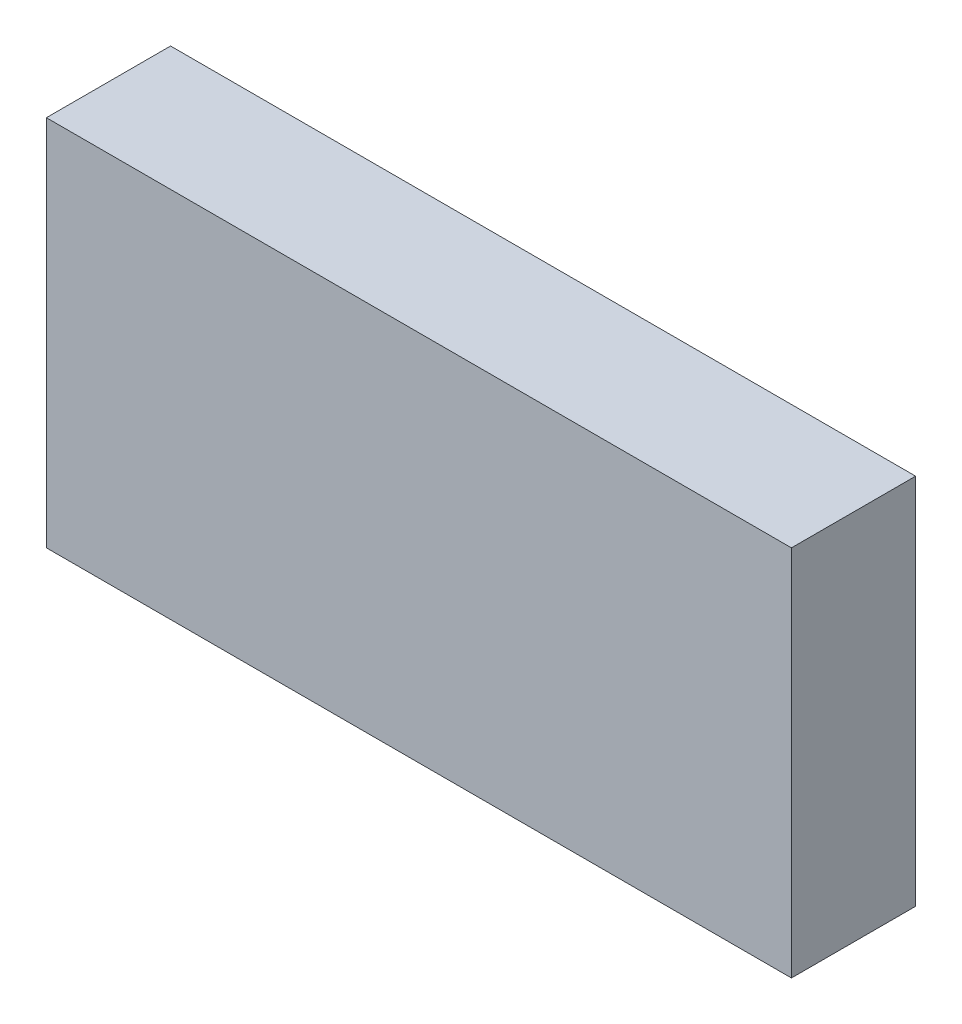
ISO-10303-21;
HEADER;
FILE_DESCRIPTION(('STEP AP214'),'2;1');
FILE_NAME('part.step','',(''),(''),'','','');
FILE_SCHEMA(('AUTOMOTIVE_DESIGN { 1 0 10303 214 1 1 1 1 }'));
ENDSEC;
DATA;
#1=APPLICATION_CONTEXT('core data for automotive mechanical design processes');
#2=APPLICATION_PROTOCOL_DEFINITION('international standard','automotive_design',2000,#1);
#3=PRODUCT_CONTEXT('',#1,'mechanical');
#4=PRODUCT('Part','Part','',(#3));
#5=PRODUCT_RELATED_PRODUCT_CATEGORY('part','',(#4));
#6=PRODUCT_DEFINITION_FORMATION('','',#4);
#7=PRODUCT_DEFINITION_CONTEXT('part definition',#1,'design');
#8=PRODUCT_DEFINITION('design','',#6,#7);
#9=PRODUCT_DEFINITION_SHAPE('','',#8);
#10=(LENGTH_UNIT() NAMED_UNIT(*) SI_UNIT(.MILLI.,.METRE.));
#11=(NAMED_UNIT(*) PLANE_ANGLE_UNIT() SI_UNIT($,.RADIAN.));
#12=(NAMED_UNIT(*) SI_UNIT($,.STERADIAN.) SOLID_ANGLE_UNIT());
#13=UNCERTAINTY_MEASURE_WITH_UNIT(LENGTH_MEASURE(1.E-05),#10,'distance_accuracy_value','');
#14=(GEOMETRIC_REPRESENTATION_CONTEXT(3) GLOBAL_UNCERTAINTY_ASSIGNED_CONTEXT((#13)) GLOBAL_UNIT_ASSIGNED_CONTEXT((#10,
#11,#12)) REPRESENTATION_CONTEXT('',''));
#15=CARTESIAN_POINT('',(0.,0.,0.));
#16=DIRECTION('',(0.,0.,1.));
#17=DIRECTION('',(1.,0.,0.));
#18=AXIS2_PLACEMENT_3D('',#15,#16,#17);
#19=CARTESIAN_POINT('',(0.,0.,5.));
#20=DIRECTION('',(1.,0.,0.));
#21=DIRECTION('',(0.,0.,-1.));
#22=AXIS2_PLACEMENT_3D('',#19,#20,#21);
#23=PLANE('',#22);
#24=DIRECTION('',(0.,-1.,0.));
#25=VECTOR('',#24,1.);
#26=CARTESIAN_POINT('',(0.,0.,0.));
#27=LINE('',#26,#25);
#28=CARTESIAN_POINT('',(0.,15.,0.));
#29=VERTEX_POINT('',#28);
#30=CARTESIAN_POINT('',(0.,0.,0.));
#31=VERTEX_POINT('',#30);
#32=EDGE_CURVE('E95',#29,#31,#27,.T.);
#33=ORIENTED_EDGE('',*,*,#32,.T.);
#34=DIRECTION('',(0.,0.,-1.));
#35=VECTOR('',#34,1.);
#36=CARTESIAN_POINT('',(0.,0.,5.));
#37=LINE('',#36,#35);
#38=CARTESIAN_POINT('',(0.,0.,5.));
#39=VERTEX_POINT('',#38);
#40=EDGE_CURVE('E11',#39,#31,#37,.T.);
#41=ORIENTED_EDGE('',*,*,#40,.F.);
#42=DIRECTION('',(0.,-1.,0.));
#43=VECTOR('',#42,1.);
#44=CARTESIAN_POINT('',(0.,0.,5.));
#45=LINE('',#44,#43);
#46=CARTESIAN_POINT('',(0.,15.,5.));
#47=VERTEX_POINT('',#46);
#48=EDGE_CURVE('E83',#47,#39,#45,.T.);
#49=ORIENTED_EDGE('',*,*,#48,.F.);
#50=DIRECTION('',(0.,0.,-1.));
#51=VECTOR('',#50,1.);
#52=CARTESIAN_POINT('',(0.,15.,5.));
#53=LINE('',#52,#51);
#54=EDGE_CURVE('E91',#47,#29,#53,.T.);
#55=ORIENTED_EDGE('',*,*,#54,.T.);
#56=EDGE_LOOP('',(#33,#41,#49,#55));
#57=FACE_BOUND('',#56,.T.);
#58=ADVANCED_FACE('F32',(#57),#23,.F.);
#59=CARTESIAN_POINT('',(0.,0.,5.));
#60=DIRECTION('',(0.,1.,0.));
#61=DIRECTION('',(0.,0.,1.));
#62=AXIS2_PLACEMENT_3D('',#59,#60,#61);
#63=PLANE('',#62);
#64=DIRECTION('',(1.,0.,0.));
#65=VECTOR('',#64,1.);
#66=CARTESIAN_POINT('',(0.,0.,0.));
#67=LINE('',#66,#65);
#68=CARTESIAN_POINT('',(30.,0.,0.));
#69=VERTEX_POINT('',#68);
#70=EDGE_CURVE('E87',#31,#69,#67,.T.);
#71=ORIENTED_EDGE('',*,*,#70,.T.);
#72=DIRECTION('',(0.,0.,-1.));
#73=VECTOR('',#72,1.);
#74=CARTESIAN_POINT('',(30.,0.,5.));
#75=LINE('',#74,#73);
#76=CARTESIAN_POINT('',(30.,0.,5.));
#77=VERTEX_POINT('',#76);
#78=EDGE_CURVE('E40',#77,#69,#75,.T.);
#79=ORIENTED_EDGE('',*,*,#78,.F.);
#80=DIRECTION('',(1.,0.,0.));
#81=VECTOR('',#80,1.);
#82=CARTESIAN_POINT('',(0.,0.,5.));
#83=LINE('',#82,#81);
#84=EDGE_CURVE('E78',#39,#77,#83,.T.);
#85=ORIENTED_EDGE('',*,*,#84,.F.);
#86=ORIENTED_EDGE('',*,*,#40,.T.);
#87=EDGE_LOOP('',(#71,#79,#85,#86));
#88=FACE_BOUND('',#87,.T.);
#89=ADVANCED_FACE('F86',(#88),#63,.F.);
#90=CARTESIAN_POINT('',(30.,0.,5.));
#91=DIRECTION('',(-1.,0.,0.));
#92=DIRECTION('',(0.,0.,1.));
#93=AXIS2_PLACEMENT_3D('',#90,#91,#92);
#94=PLANE('',#93);
#95=DIRECTION('',(0.,1.,0.));
#96=VECTOR('',#95,1.);
#97=CARTESIAN_POINT('',(30.,0.,0.));
#98=LINE('',#97,#96);
#99=CARTESIAN_POINT('',(30.,15.,0.));
#100=VERTEX_POINT('',#99);
#101=EDGE_CURVE('E65',#69,#100,#98,.T.);
#102=ORIENTED_EDGE('',*,*,#101,.T.);
#103=DIRECTION('',(0.,0.,-1.));
#104=VECTOR('',#103,1.);
#105=CARTESIAN_POINT('',(30.,15.,5.));
#106=LINE('',#105,#104);
#107=CARTESIAN_POINT('',(30.,15.,5.));
#108=VERTEX_POINT('',#107);
#109=EDGE_CURVE('E88',#108,#100,#106,.T.);
#110=ORIENTED_EDGE('',*,*,#109,.F.);
#111=DIRECTION('',(0.,1.,0.));
#112=VECTOR('',#111,1.);
#113=CARTESIAN_POINT('',(30.,0.,5.));
#114=LINE('',#113,#112);
#115=EDGE_CURVE('E81',#77,#108,#114,.T.);
#116=ORIENTED_EDGE('',*,*,#115,.F.);
#117=ORIENTED_EDGE('',*,*,#78,.T.);
#118=EDGE_LOOP('',(#102,#110,#116,#117));
#119=FACE_BOUND('',#118,.T.);
#120=ADVANCED_FACE('F89',(#119),#94,.F.);
#121=CARTESIAN_POINT('',(0.,15.,5.));
#122=DIRECTION('',(0.,-1.,0.));
#123=DIRECTION('',(0.,0.,-1.));
#124=AXIS2_PLACEMENT_3D('',#121,#122,#123);
#125=PLANE('',#124);
#126=DIRECTION('',(-1.,0.,0.));
#127=VECTOR('',#126,1.);
#128=CARTESIAN_POINT('',(0.,15.,0.));
#129=LINE('',#128,#127);
#130=EDGE_CURVE('E71',#100,#29,#129,.T.);
#131=ORIENTED_EDGE('',*,*,#130,.T.);
#132=ORIENTED_EDGE('',*,*,#54,.F.);
#133=DIRECTION('',(-1.,0.,0.));
#134=VECTOR('',#133,1.);
#135=CARTESIAN_POINT('',(0.,15.,5.));
#136=LINE('',#135,#134);
#137=EDGE_CURVE('E48',#108,#47,#136,.T.);
#138=ORIENTED_EDGE('',*,*,#137,.F.);
#139=ORIENTED_EDGE('',*,*,#109,.T.);
#140=EDGE_LOOP('',(#131,#132,#138,#139));
#141=FACE_BOUND('',#140,.T.);
#142=ADVANCED_FACE('F102',(#141),#125,.F.);
#143=CARTESIAN_POINT('',(0.,0.,5.));
#144=DIRECTION('',(0.,0.,-1.));
#145=DIRECTION('',(-1.,0.,0.));
#146=AXIS2_PLACEMENT_3D('',#143,#144,#145);
#147=PLANE('',#146);
#148=ORIENTED_EDGE('',*,*,#48,.T.);
#149=ORIENTED_EDGE('',*,*,#84,.T.);
#150=ORIENTED_EDGE('',*,*,#115,.T.);
#151=ORIENTED_EDGE('',*,*,#137,.T.);
#152=EDGE_LOOP('',(#148,#149,#150,#151));
#153=FACE_BOUND('',#152,.T.);
#154=ADVANCED_FACE('F79',(#153),#147,.F.);
#155=CARTESIAN_POINT('',(0.,0.,0.));
#156=DIRECTION('',(0.,0.,-1.));
#157=DIRECTION('',(-1.,0.,0.));
#158=AXIS2_PLACEMENT_3D('',#155,#156,#157);
#159=PLANE('',#158);
#160=ORIENTED_EDGE('',*,*,#32,.F.);
#161=ORIENTED_EDGE('',*,*,#130,.F.);
#162=ORIENTED_EDGE('',*,*,#101,.F.);
#163=ORIENTED_EDGE('',*,*,#70,.F.);
#164=EDGE_LOOP('',(#160,#161,#162,#163));
#165=FACE_BOUND('',#164,.T.);
#166=ADVANCED_FACE('F105',(#165),#159,.T.);
#167=CLOSED_SHELL('',(#58,#89,#120,#142,#154,#166));
#168=MANIFOLD_SOLID_BREP('B2',#167);
#169=ADVANCED_BREP_SHAPE_REPRESENTATION('',(#18,#168),#14);
#170=SHAPE_DEFINITION_REPRESENTATION(#9,#169);
ENDSEC;
END-ISO-10303-21;
